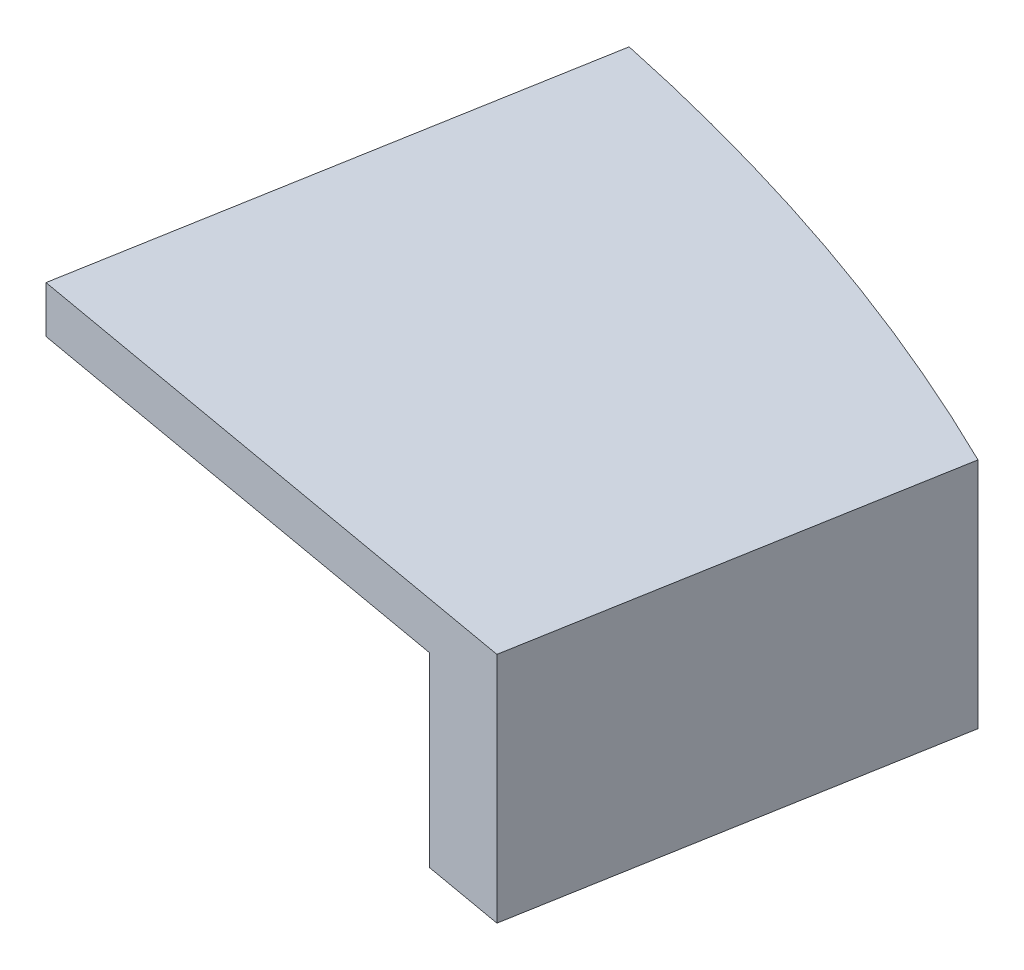
ISO-10303-21;
HEADER;
FILE_DESCRIPTION(('STEP AP214'),'2;1');
FILE_NAME('part.step','',(''),(''),'','','');
FILE_SCHEMA(('AUTOMOTIVE_DESIGN { 1 0 10303 214 1 1 1 1 }'));
ENDSEC;
DATA;
#1=APPLICATION_CONTEXT('core data for automotive mechanical design processes');
#2=APPLICATION_PROTOCOL_DEFINITION('international standard','automotive_design',2000,#1);
#3=PRODUCT_CONTEXT('',#1,'mechanical');
#4=PRODUCT('Part','Part','',(#3));
#5=PRODUCT_RELATED_PRODUCT_CATEGORY('part','',(#4));
#6=PRODUCT_DEFINITION_FORMATION('','',#4);
#7=PRODUCT_DEFINITION_CONTEXT('part definition',#1,'design');
#8=PRODUCT_DEFINITION('design','',#6,#7);
#9=PRODUCT_DEFINITION_SHAPE('','',#8);
#10=(LENGTH_UNIT() NAMED_UNIT(*) SI_UNIT(.MILLI.,.METRE.));
#11=(NAMED_UNIT(*) PLANE_ANGLE_UNIT() SI_UNIT($,.RADIAN.));
#12=(NAMED_UNIT(*) SI_UNIT($,.STERADIAN.) SOLID_ANGLE_UNIT());
#13=UNCERTAINTY_MEASURE_WITH_UNIT(LENGTH_MEASURE(1.E-05),#10,'distance_accuracy_value','');
#14=(GEOMETRIC_REPRESENTATION_CONTEXT(3) GLOBAL_UNCERTAINTY_ASSIGNED_CONTEXT((#13)) GLOBAL_UNIT_ASSIGNED_CONTEXT((#10,
#11,#12)) REPRESENTATION_CONTEXT('',''));
#15=CARTESIAN_POINT('',(0.,0.,0.));
#16=DIRECTION('',(0.,0.,1.));
#17=DIRECTION('',(1.,0.,0.));
#18=AXIS2_PLACEMENT_3D('',#15,#16,#17);
#19=CARTESIAN_POINT('',(0.,10.8477176873948,0.));
#20=DIRECTION('',(0.,1.,0.));
#21=DIRECTION('',(0.,0.,1.));
#22=AXIS2_PLACEMENT_3D('',#19,#20,#21);
#23=PLANE('',#22);
#24=DIRECTION('',(-0.984807753012208,0.,-0.173648177666934));
#25=VECTOR('',#24,1.);
#26=CARTESIAN_POINT('',(16.9061300394809,10.8477176873948,-57.7020650863443));
#27=LINE('',#26,#25);
#28=CARTESIAN_POINT('',(33.6478618406884,10.8477176873948,-54.7500460660064));
#29=VERTEX_POINT('',#28);
#30=CARTESIAN_POINT('',(16.9061300284706,10.8477176873948,-57.7020650882857));
#31=VERTEX_POINT('',#30);
#32=EDGE_CURVE('E126',#29,#31,#27,.T.);
#33=ORIENTED_EDGE('',*,*,#32,.F.);
#34=DIRECTION('',(0.173648177666934,0.,-0.984807753012207));
#35=VECTOR('',#34,1.);
#36=CARTESIAN_POINT('',(33.6478618406884,10.8477176873948,-54.7500460660064));
#37=LINE('',#36,#35);
#38=CARTESIAN_POINT('',(31.4598948020851,10.8477176873948,-42.3414683780527));
#39=VERTEX_POINT('',#38);
#40=EDGE_CURVE('E63',#39,#29,#37,.T.);
#41=ORIENTED_EDGE('',*,*,#40,.F.);
#42=DIRECTION('',(0.984807753012208,0.,0.17364817766693));
#43=VECTOR('',#42,1.);
#44=CARTESIAN_POINT('',(14.7181630432246,10.8477176873948,-45.2934873909236));
#45=LINE('',#44,#43);
#46=CARTESIAN_POINT('',(14.7181630432246,10.8477176873948,-45.2934873909236));
#47=VERTEX_POINT('',#46);
#48=EDGE_CURVE('E141',#47,#39,#45,.T.);
#49=ORIENTED_EDGE('',*,*,#48,.F.);
#50=DIRECTION('',(-0.173648173432221,0.,0.984807753758902));
#51=VECTOR('',#50,1.);
#52=CARTESIAN_POINT('',(17.8631238430015,10.8477176873948,-63.1294468465922));
#53=LINE('',#52,#51);
#54=EDGE_CURVE('E58',#31,#47,#53,.T.);
#55=ORIENTED_EDGE('',*,*,#54,.F.);
#56=EDGE_LOOP('',(#33,#41,#49,#55));
#57=FACE_BOUND('',#56,.T.);
#58=ADVANCED_FACE('F39',(#57),#23,.F.);
#59=CARTESIAN_POINT('',(0.,10.8477176873948,0.));
#60=DIRECTION('',(0.,1.,0.));
#61=DIRECTION('',(-1.,0.,0.));
#62=AXIS2_PLACEMENT_3D('',#59,#60,#61);
#63=ELLIPSE('',#62,75.,65.);
#64=DIRECTION('',(0.,1.,0.));
#65=VECTOR('',#64,1.);
#66=SURFACE_OF_LINEAR_EXTRUSION('',#63,#65);
#67=CARTESIAN_POINT('',(0.,12.5277176873948,0.));
#68=DIRECTION('',(0.,1.,0.));
#69=DIRECTION('',(-1.,0.,0.));
#70=AXIS2_PLACEMENT_3D('',#67,#68,#69);
#71=ELLIPSE('',#70,75.,65.);
#72=CARTESIAN_POINT('',(37.0089191019465,12.5277176873948,-56.5352375570432));
#73=VERTEX_POINT('',#72);
#74=CARTESIAN_POINT('',(17.8631238430015,12.5277176873948,-63.1294468465922));
#75=VERTEX_POINT('',#74);
#76=EDGE_CURVE('E145',#73,#75,#71,.T.);
#77=ORIENTED_EDGE('',*,*,#76,.F.);
#78=DIRECTION('',(0.,1.,0.));
#79=VECTOR('',#78,1.);
#80=CARTESIAN_POINT('',(37.0089191019465,10.8477176873948,-56.5352375570432));
#81=LINE('',#80,#79);
#82=CARTESIAN_POINT('',(37.0089191019465,4.15228231260525,-56.5352375570432));
#83=VERTEX_POINT('',#82);
#84=EDGE_CURVE('E11',#83,#73,#81,.T.);
#85=ORIENTED_EDGE('',*,*,#84,.F.);
#86=CARTESIAN_POINT('',(0.,4.15228231260525,0.));
#87=DIRECTION('',(0.,-1.,0.));
#88=DIRECTION('',(-1.,0.,0.));
#89=AXIS2_PLACEMENT_3D('',#86,#87,#88);
#90=ELLIPSE('',#89,75.,65.);
#91=CARTESIAN_POINT('',(17.8631238430015,4.15228231260525,-63.1294468465922));
#92=VERTEX_POINT('',#91);
#93=EDGE_CURVE('E172',#92,#83,#90,.T.);
#94=ORIENTED_EDGE('',*,*,#93,.F.);
#95=DIRECTION('',(0.,1.,0.));
#96=VECTOR('',#95,1.);
#97=CARTESIAN_POINT('',(17.8631238430015,10.8477176873948,-63.1294468465922));
#98=LINE('',#97,#96);
#99=EDGE_CURVE('E44',#92,#75,#98,.T.);
#100=ORIENTED_EDGE('',*,*,#99,.T.);
#101=EDGE_LOOP('',(#77,#85,#94,#100));
#102=FACE_BOUND('',#101,.T.);
#103=ADVANCED_FACE('F41',(#102),#66,.T.);
#104=CARTESIAN_POINT('',(34.4143180611218,10.8477176873948,-41.8205238450519));
#105=DIRECTION('',(0.98480775301221,0.,0.173648177666922));
#106=DIRECTION('',(0.173648177666922,0.,-0.98480775301221));
#107=AXIS2_PLACEMENT_3D('',#104,#105,#106);
#108=PLANE('',#107);
#109=DIRECTION('',(0.173648177666922,0.,-0.98480775301221));
#110=VECTOR('',#109,1.);
#111=CARTESIAN_POINT('',(34.4143180611218,12.5277176873948,-41.8205238450519));
#112=LINE('',#111,#110);
#113=CARTESIAN_POINT('',(34.4143180611218,12.5277176873948,-41.8205238450519));
#114=VERTEX_POINT('',#113);
#115=EDGE_CURVE('E142',#114,#73,#112,.T.);
#116=ORIENTED_EDGE('',*,*,#115,.F.);
#117=DIRECTION('',(0.,1.,0.));
#118=VECTOR('',#117,1.);
#119=CARTESIAN_POINT('',(34.4143180611218,10.8477176873948,-41.8205238450519));
#120=LINE('',#119,#118);
#121=CARTESIAN_POINT('',(34.4143180611217,4.15228231260526,-41.8205238450519));
#122=VERTEX_POINT('',#121);
#123=EDGE_CURVE('E50',#122,#114,#120,.T.);
#124=ORIENTED_EDGE('',*,*,#123,.F.);
#125=DIRECTION('',(-0.173648177666922,0.,0.98480775301221));
#126=VECTOR('',#125,1.);
#127=CARTESIAN_POINT('',(34.4143180611218,4.15228231260525,-41.8205238450519));
#128=LINE('',#127,#126);
#129=EDGE_CURVE('E180',#83,#122,#128,.T.);
#130=ORIENTED_EDGE('',*,*,#129,.F.);
#131=ORIENTED_EDGE('',*,*,#84,.T.);
#132=EDGE_LOOP('',(#116,#124,#130,#131));
#133=FACE_BOUND('',#132,.T.);
#134=ADVANCED_FACE('F178',(#133),#108,.T.);
#135=CARTESIAN_POINT('',(14.7181630432246,10.8477176873948,-45.2934873909236));
#136=DIRECTION('',(-0.17364817766693,0.,0.984807753012208));
#137=DIRECTION('',(0.984807753012208,0.,0.17364817766693));
#138=AXIS2_PLACEMENT_3D('',#135,#136,#137);
#139=PLANE('',#138);
#140=DIRECTION('',(0.984807753012208,0.,0.17364817766693));
#141=VECTOR('',#140,1.);
#142=CARTESIAN_POINT('',(14.7181630432246,12.5277176873948,-45.2934873909236));
#143=LINE('',#142,#141);
#144=CARTESIAN_POINT('',(14.7181630432246,12.5277176873948,-45.2934873909236));
#145=VERTEX_POINT('',#144);
#146=EDGE_CURVE('E153',#145,#114,#143,.T.);
#147=ORIENTED_EDGE('',*,*,#146,.F.);
#148=DIRECTION('',(0.,1.,0.));
#149=VECTOR('',#148,1.);
#150=CARTESIAN_POINT('',(14.7181630432246,10.8477176873948,-45.2934873909236));
#151=LINE('',#150,#149);
#152=EDGE_CURVE('E161',#47,#145,#151,.T.);
#153=ORIENTED_EDGE('',*,*,#152,.F.);
#154=ORIENTED_EDGE('',*,*,#48,.T.);
#155=DIRECTION('',(0.,1.,0.));
#156=VECTOR('',#155,1.);
#157=CARTESIAN_POINT('',(31.4598948020851,-25.1426375127768,-42.3414683780527));
#158=LINE('',#157,#156);
#159=CARTESIAN_POINT('',(31.4598948020851,4.15228231260525,-42.3414683780527));
#160=VERTEX_POINT('',#159);
#161=EDGE_CURVE('E131',#160,#39,#158,.T.);
#162=ORIENTED_EDGE('',*,*,#161,.F.);
#163=DIRECTION('',(-0.984807753012208,0.,-0.173648177666928));
#164=VECTOR('',#163,1.);
#165=CARTESIAN_POINT('',(31.4598948020851,4.15228231260525,-42.3414683780527));
#166=LINE('',#165,#164);
#167=EDGE_CURVE('E107',#122,#160,#166,.T.);
#168=ORIENTED_EDGE('',*,*,#167,.F.);
#169=ORIENTED_EDGE('',*,*,#123,.T.);
#170=EDGE_LOOP('',(#147,#153,#154,#162,#168,#169));
#171=FACE_BOUND('',#170,.T.);
#172=ADVANCED_FACE('F202',(#171),#139,.T.);
#173=CARTESIAN_POINT('',(17.8631238430015,10.8477176873948,-63.1294468465922));
#174=DIRECTION('',(-0.984807753758902,0.,-0.173648173432221));
#175=DIRECTION('',(-0.173648173432221,0.,0.984807753758902));
#176=AXIS2_PLACEMENT_3D('',#173,#174,#175);
#177=PLANE('',#176);
#178=DIRECTION('',(-0.173648173432221,0.,0.984807753758902));
#179=VECTOR('',#178,1.);
#180=CARTESIAN_POINT('',(17.8631238430015,12.5277176873948,-63.1294468465922));
#181=LINE('',#180,#179);
#182=EDGE_CURVE('E149',#75,#145,#181,.T.);
#183=ORIENTED_EDGE('',*,*,#182,.F.);
#184=ORIENTED_EDGE('',*,*,#99,.F.);
#185=DIRECTION('',(0.17364817143439,0.,-0.984807754111173));
#186=VECTOR('',#185,1.);
#187=CARTESIAN_POINT('',(17.8631238430015,4.15228231260525,-63.1294468465922));
#188=LINE('',#187,#186);
#189=CARTESIAN_POINT('',(16.9061300394809,4.15228231260525,-57.7020650863443));
#190=VERTEX_POINT('',#189);
#191=EDGE_CURVE('E122',#190,#92,#188,.T.);
#192=ORIENTED_EDGE('',*,*,#191,.F.);
#193=DIRECTION('',(0.,1.,0.));
#194=VECTOR('',#193,1.);
#195=CARTESIAN_POINT('',(16.9061300394809,-25.1426375127768,-57.7020650863443));
#196=LINE('',#195,#194);
#197=EDGE_CURVE('E113',#190,#31,#196,.T.);
#198=ORIENTED_EDGE('',*,*,#197,.T.);
#199=ORIENTED_EDGE('',*,*,#54,.T.);
#200=ORIENTED_EDGE('',*,*,#152,.T.);
#201=EDGE_LOOP('',(#183,#184,#192,#198,#199,#200));
#202=FACE_BOUND('',#201,.T.);
#203=ADVANCED_FACE('F173',(#202),#177,.T.);
#204=CARTESIAN_POINT('',(0.,12.5277176873948,0.));
#205=DIRECTION('',(0.,1.,0.));
#206=DIRECTION('',(0.,0.,1.));
#207=AXIS2_PLACEMENT_3D('',#204,#205,#206);
#208=PLANE('',#207);
#209=ORIENTED_EDGE('',*,*,#76,.T.);
#210=ORIENTED_EDGE('',*,*,#182,.T.);
#211=ORIENTED_EDGE('',*,*,#146,.T.);
#212=ORIENTED_EDGE('',*,*,#115,.T.);
#213=EDGE_LOOP('',(#209,#210,#211,#212));
#214=FACE_BOUND('',#213,.T.);
#215=ADVANCED_FACE('F175',(#214),#208,.T.);
#216=CARTESIAN_POINT('',(33.6478618406884,-25.1426375127768,-54.7500460660064));
#217=DIRECTION('',(0.984807753012207,0.,0.173648177666934));
#218=DIRECTION('',(0.173648177666934,0.,-0.984807753012207));
#219=AXIS2_PLACEMENT_3D('',#216,#217,#218);
#220=PLANE('',#219);
#221=DIRECTION('',(0.173648177666934,0.,-0.984807753012207));
#222=VECTOR('',#221,1.);
#223=CARTESIAN_POINT('',(33.6478618406884,4.15228231260525,-54.7500460660064));
#224=LINE('',#223,#222);
#225=CARTESIAN_POINT('',(33.6478618406884,4.15228231260525,-54.7500460660064));
#226=VERTEX_POINT('',#225);
#227=EDGE_CURVE('E99',#160,#226,#224,.T.);
#228=ORIENTED_EDGE('',*,*,#227,.F.);
#229=ORIENTED_EDGE('',*,*,#161,.T.);
#230=ORIENTED_EDGE('',*,*,#40,.T.);
#231=DIRECTION('',(0.,1.,0.));
#232=VECTOR('',#231,1.);
#233=CARTESIAN_POINT('',(33.6478618406884,-25.1426375127768,-54.7500460660064));
#234=LINE('',#233,#232);
#235=EDGE_CURVE('E119',#226,#29,#234,.T.);
#236=ORIENTED_EDGE('',*,*,#235,.F.);
#237=EDGE_LOOP('',(#228,#229,#230,#236));
#238=FACE_BOUND('',#237,.T.);
#239=ADVANCED_FACE('F124',(#238),#220,.F.);
#240=CARTESIAN_POINT('',(16.9061300394809,-25.1426375127768,-57.7020650863443));
#241=DIRECTION('',(0.173648177666934,0.,-0.984807753012208));
#242=DIRECTION('',(-0.984807753012208,0.,-0.173648177666934));
#243=AXIS2_PLACEMENT_3D('',#240,#241,#242);
#244=PLANE('',#243);
#245=DIRECTION('',(-0.984807753012208,0.,-0.173648177666934));
#246=VECTOR('',#245,1.);
#247=CARTESIAN_POINT('',(16.9061300394809,4.15228231260525,-57.7020650863443));
#248=LINE('',#247,#246);
#249=EDGE_CURVE('E103',#226,#190,#248,.T.);
#250=ORIENTED_EDGE('',*,*,#249,.F.);
#251=ORIENTED_EDGE('',*,*,#235,.T.);
#252=ORIENTED_EDGE('',*,*,#32,.T.);
#253=ORIENTED_EDGE('',*,*,#197,.F.);
#254=EDGE_LOOP('',(#250,#251,#252,#253));
#255=FACE_BOUND('',#254,.T.);
#256=ADVANCED_FACE('F117',(#255),#244,.F.);
#257=CARTESIAN_POINT('',(27.1882102701562,4.15228231260526,-57.4043881724579));
#258=DIRECTION('',(0.,-1.,0.));
#259=DIRECTION('',(0.,0.,-1.));
#260=AXIS2_PLACEMENT_3D('',#257,#258,#259);
#261=PLANE('',#260);
#262=ORIENTED_EDGE('',*,*,#227,.T.);
#263=ORIENTED_EDGE('',*,*,#249,.T.);
#264=ORIENTED_EDGE('',*,*,#191,.T.);
#265=ORIENTED_EDGE('',*,*,#93,.T.);
#266=ORIENTED_EDGE('',*,*,#129,.T.);
#267=ORIENTED_EDGE('',*,*,#167,.T.);
#268=EDGE_LOOP('',(#262,#263,#264,#265,#266,#267));
#269=FACE_BOUND('',#268,.T.);
#270=ADVANCED_FACE('F101',(#269),#261,.T.);
#271=CLOSED_SHELL('',(#58,#103,#134,#172,#203,#215,#239,#256,#270));
#272=MANIFOLD_SOLID_BREP('B2',#271);
#273=ADVANCED_BREP_SHAPE_REPRESENTATION('',(#18,#272),#14);
#274=SHAPE_DEFINITION_REPRESENTATION(#9,#273);
ENDSEC;
END-ISO-10303-21;
